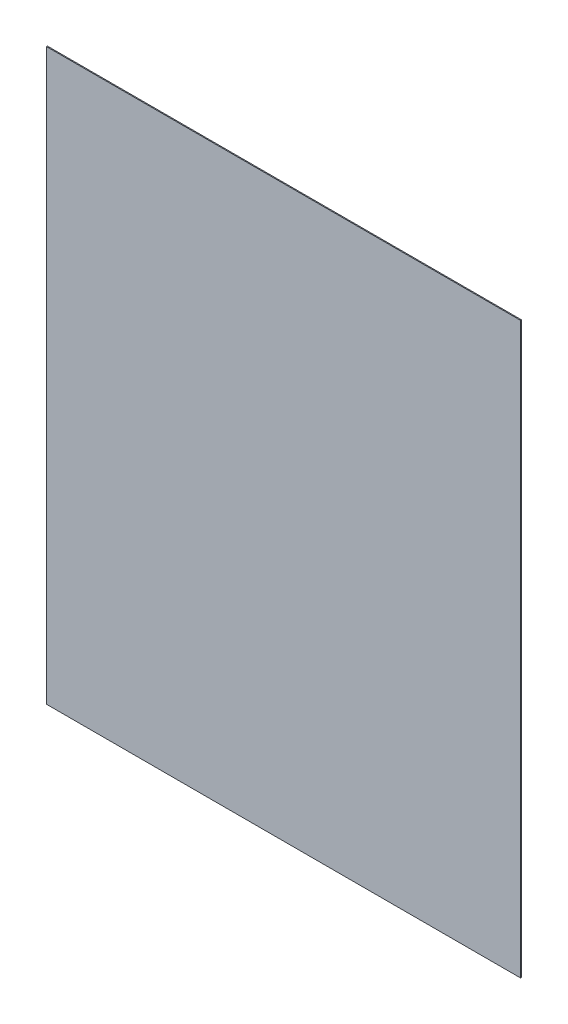
ISO-10303-21;
HEADER;
FILE_DESCRIPTION(('STEP AP214'),'2;1');
FILE_NAME('part.step','',(''),(''),'','','');
FILE_SCHEMA(('AUTOMOTIVE_DESIGN { 1 0 10303 214 1 1 1 1 }'));
ENDSEC;
DATA;
#1=APPLICATION_CONTEXT('core data for automotive mechanical design processes');
#2=APPLICATION_PROTOCOL_DEFINITION('international standard','automotive_design',2000,#1);
#3=PRODUCT_CONTEXT('',#1,'mechanical');
#4=PRODUCT('Part','Part','',(#3));
#5=PRODUCT_RELATED_PRODUCT_CATEGORY('part','',(#4));
#6=PRODUCT_DEFINITION_FORMATION('','',#4);
#7=PRODUCT_DEFINITION_CONTEXT('part definition',#1,'design');
#8=PRODUCT_DEFINITION('design','',#6,#7);
#9=PRODUCT_DEFINITION_SHAPE('','',#8);
#10=(LENGTH_UNIT() NAMED_UNIT(*) SI_UNIT(.MILLI.,.METRE.));
#11=(NAMED_UNIT(*) PLANE_ANGLE_UNIT() SI_UNIT($,.RADIAN.));
#12=(NAMED_UNIT(*) SI_UNIT($,.STERADIAN.) SOLID_ANGLE_UNIT());
#13=UNCERTAINTY_MEASURE_WITH_UNIT(LENGTH_MEASURE(1.E-05),#10,'distance_accuracy_value','');
#14=(GEOMETRIC_REPRESENTATION_CONTEXT(3) GLOBAL_UNCERTAINTY_ASSIGNED_CONTEXT((#13)) GLOBAL_UNIT_ASSIGNED_CONTEXT((#10,
#11,#12)) REPRESENTATION_CONTEXT('',''));
#15=CARTESIAN_POINT('',(0.,0.,0.));
#16=DIRECTION('',(0.,0.,1.));
#17=DIRECTION('',(1.,0.,0.));
#18=AXIS2_PLACEMENT_3D('',#15,#16,#17);
#19=CARTESIAN_POINT('',(-7.961839813E-06,-2.031834983463E-05,0.00100076));
#20=DIRECTION('',(0.,0.,1.));
#21=DIRECTION('',(1.,0.,0.));
#22=AXIS2_PLACEMENT_3D('',#19,#20,#21);
#23=PLANE('',#22);
#24=DIRECTION('',(0.,1.,0.));
#25=VECTOR('',#24,1.);
#26=CARTESIAN_POINT('',(0.25022048,-0.30055312,0.00100076));
#27=LINE('',#26,#25);
#28=CARTESIAN_POINT('',(0.25022048,-0.30055312,0.00100076));
#29=VERTEX_POINT('',#28);
#30=CARTESIAN_POINT('',(0.25022048,0.30047184,0.00100076));
#31=VERTEX_POINT('',#30);
#32=EDGE_CURVE('E76',#29,#31,#27,.T.);
#33=ORIENTED_EDGE('',*,*,#32,.T.);
#34=DIRECTION('',(-0.999999986810264,0.000162417583628743,0.));
#35=VECTOR('',#34,1.);
#36=CARTESIAN_POINT('',(0.25022048,0.30047184,0.00100076));
#37=LINE('',#36,#35);
#38=CARTESIAN_POINT('',(-0.25021794,0.30055312,0.00100076));
#39=VERTEX_POINT('',#38);
#40=EDGE_CURVE('E74',#31,#39,#37,.T.);
#41=ORIENTED_EDGE('',*,*,#40,.T.);
#42=DIRECTION('',(0.,-1.,0.));
#43=VECTOR('',#42,1.);
#44=CARTESIAN_POINT('',(-0.25021794,0.30055312,0.00100076));
#45=LINE('',#44,#43);
#46=CARTESIAN_POINT('',(-0.25021794,-0.30055312,0.00100076));
#47=VERTEX_POINT('',#46);
#48=EDGE_CURVE('E61',#39,#47,#45,.T.);
#49=ORIENTED_EDGE('',*,*,#48,.T.);
#50=DIRECTION('',(1.,0.,0.));
#51=VECTOR('',#50,1.);
#52=CARTESIAN_POINT('',(-0.25021794,-0.30055312,0.00100076));
#53=LINE('',#52,#51);
#54=EDGE_CURVE('E11',#47,#29,#53,.T.);
#55=ORIENTED_EDGE('',*,*,#54,.T.);
#56=EDGE_LOOP('',(#33,#41,#49,#55));
#57=FACE_BOUND('',#56,.T.);
#58=ADVANCED_FACE('F17',(#57),#23,.T.);
#59=CARTESIAN_POINT('',(-7.961839813E-06,-2.031834983463E-05,0.));
#60=DIRECTION('',(0.,0.,1.));
#61=DIRECTION('',(1.,0.,0.));
#62=AXIS2_PLACEMENT_3D('',#59,#60,#61);
#63=PLANE('',#62);
#64=DIRECTION('',(1.,0.,0.));
#65=VECTOR('',#64,1.);
#66=CARTESIAN_POINT('',(-0.25021794,-0.30055312,0.));
#67=LINE('',#66,#65);
#68=CARTESIAN_POINT('',(-0.25021794,-0.30055312,0.));
#69=VERTEX_POINT('',#68);
#70=CARTESIAN_POINT('',(0.25022048,-0.30055312,0.));
#71=VERTEX_POINT('',#70);
#72=EDGE_CURVE('E20',#69,#71,#67,.T.);
#73=ORIENTED_EDGE('',*,*,#72,.F.);
#74=DIRECTION('',(0.,-1.,0.));
#75=VECTOR('',#74,1.);
#76=CARTESIAN_POINT('',(-0.25021794,0.30055312,0.));
#77=LINE('',#76,#75);
#78=CARTESIAN_POINT('',(-0.25021794,0.30055312,0.));
#79=VERTEX_POINT('',#78);
#80=EDGE_CURVE('E81',#79,#69,#77,.T.);
#81=ORIENTED_EDGE('',*,*,#80,.F.);
#82=DIRECTION('',(-0.999999986810264,0.000162417583628743,0.));
#83=VECTOR('',#82,1.);
#84=CARTESIAN_POINT('',(0.25022048,0.30047184,0.));
#85=LINE('',#84,#83);
#86=CARTESIAN_POINT('',(0.25022048,0.30047184,0.));
#87=VERTEX_POINT('',#86);
#88=EDGE_CURVE('E84',#87,#79,#85,.T.);
#89=ORIENTED_EDGE('',*,*,#88,.F.);
#90=DIRECTION('',(0.,1.,0.));
#91=VECTOR('',#90,1.);
#92=CARTESIAN_POINT('',(0.25022048,-0.30055312,0.));
#93=LINE('',#92,#91);
#94=EDGE_CURVE('E102',#71,#87,#93,.T.);
#95=ORIENTED_EDGE('',*,*,#94,.F.);
#96=EDGE_LOOP('',(#73,#81,#89,#95));
#97=FACE_BOUND('',#96,.T.);
#98=ADVANCED_FACE('F98',(#97),#63,.F.);
#99=CARTESIAN_POINT('',(-0.25021794,-0.30055312,0.));
#100=DIRECTION('',(0.,1.,0.));
#101=DIRECTION('',(1.,0.,0.));
#102=AXIS2_PLACEMENT_3D('',#99,#100,#101);
#103=PLANE('',#102);
#104=ORIENTED_EDGE('',*,*,#72,.T.);
#105=DIRECTION('',(0.,0.,1.));
#106=VECTOR('',#105,1.);
#107=CARTESIAN_POINT('',(0.25022048,-0.30055312,0.));
#108=LINE('',#107,#106);
#109=EDGE_CURVE('E89',#71,#29,#108,.T.);
#110=ORIENTED_EDGE('',*,*,#109,.T.);
#111=ORIENTED_EDGE('',*,*,#54,.F.);
#112=DIRECTION('',(0.,0.,1.));
#113=VECTOR('',#112,1.);
#114=CARTESIAN_POINT('',(-0.25021794,-0.30055312,0.));
#115=LINE('',#114,#113);
#116=EDGE_CURVE('E68',#69,#47,#115,.T.);
#117=ORIENTED_EDGE('',*,*,#116,.F.);
#118=EDGE_LOOP('',(#104,#110,#111,#117));
#119=FACE_BOUND('',#118,.T.);
#120=ADVANCED_FACE('F105',(#119),#103,.F.);
#121=CARTESIAN_POINT('',(-0.25021794,0.30055312,0.));
#122=DIRECTION('',(1.,0.,0.));
#123=DIRECTION('',(0.,1.,0.));
#124=AXIS2_PLACEMENT_3D('',#121,#122,#123);
#125=PLANE('',#124);
#126=ORIENTED_EDGE('',*,*,#80,.T.);
#127=ORIENTED_EDGE('',*,*,#116,.T.);
#128=ORIENTED_EDGE('',*,*,#48,.F.);
#129=DIRECTION('',(0.,0.,1.));
#130=VECTOR('',#129,1.);
#131=CARTESIAN_POINT('',(-0.25021794,0.30055312,0.));
#132=LINE('',#131,#130);
#133=EDGE_CURVE('E66',#79,#39,#132,.T.);
#134=ORIENTED_EDGE('',*,*,#133,.F.);
#135=EDGE_LOOP('',(#126,#127,#128,#134));
#136=FACE_BOUND('',#135,.T.);
#137=ADVANCED_FACE('F64',(#136),#125,.F.);
#138=CARTESIAN_POINT('',(0.25022048,0.30047184,0.));
#139=DIRECTION('',(-0.000162417583628743,-0.999999986810264,0.));
#140=DIRECTION('',(-0.999999986810264,0.000162417583628743,0.));
#141=AXIS2_PLACEMENT_3D('',#138,#139,#140);
#142=PLANE('',#141);
#143=ORIENTED_EDGE('',*,*,#88,.T.);
#144=ORIENTED_EDGE('',*,*,#133,.T.);
#145=ORIENTED_EDGE('',*,*,#40,.F.);
#146=DIRECTION('',(0.,0.,1.));
#147=VECTOR('',#146,1.);
#148=CARTESIAN_POINT('',(0.25022048,0.30047184,0.));
#149=LINE('',#148,#147);
#150=EDGE_CURVE('E164',#87,#31,#149,.T.);
#151=ORIENTED_EDGE('',*,*,#150,.F.);
#152=EDGE_LOOP('',(#143,#144,#145,#151));
#153=FACE_BOUND('',#152,.T.);
#154=ADVANCED_FACE('F83',(#153),#142,.F.);
#155=CARTESIAN_POINT('',(0.25022048,-0.30055312,0.));
#156=DIRECTION('',(-1.,0.,0.));
#157=DIRECTION('',(0.,0.,1.));
#158=AXIS2_PLACEMENT_3D('',#155,#156,#157);
#159=PLANE('',#158);
#160=ORIENTED_EDGE('',*,*,#94,.T.);
#161=ORIENTED_EDGE('',*,*,#150,.T.);
#162=ORIENTED_EDGE('',*,*,#32,.F.);
#163=ORIENTED_EDGE('',*,*,#109,.F.);
#164=EDGE_LOOP('',(#160,#161,#162,#163));
#165=FACE_BOUND('',#164,.T.);
#166=ADVANCED_FACE('F147',(#165),#159,.F.);
#167=CLOSED_SHELL('',(#58,#98,#120,#137,#154,#166));
#168=MANIFOLD_SOLID_BREP('B1',#167);
#169=ADVANCED_BREP_SHAPE_REPRESENTATION('',(#18,#168),#14);
#170=SHAPE_DEFINITION_REPRESENTATION(#9,#169);
ENDSEC;
END-ISO-10303-21;
